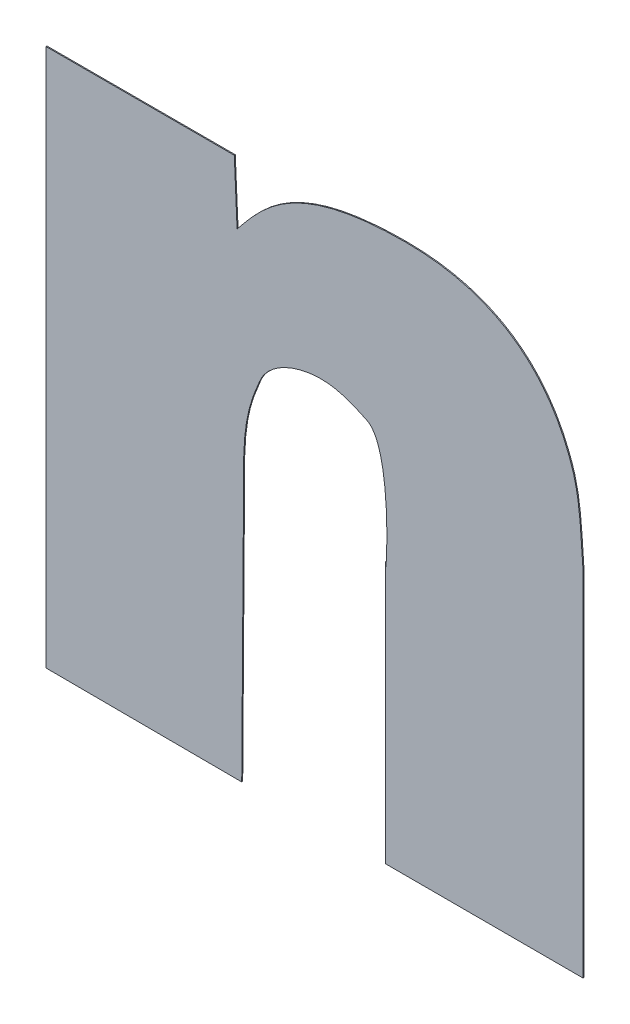
ISO-10303-21;
HEADER;
FILE_DESCRIPTION(('STEP AP214'),'2;1');
FILE_NAME('part.step','',(''),(''),'','','');
FILE_SCHEMA(('AUTOMOTIVE_DESIGN { 1 0 10303 214 1 1 1 1 }'));
ENDSEC;
DATA;
#1=APPLICATION_CONTEXT('core data for automotive mechanical design processes');
#2=APPLICATION_PROTOCOL_DEFINITION('international standard','automotive_design',2000,#1);
#3=PRODUCT_CONTEXT('',#1,'mechanical');
#4=PRODUCT('Part','Part','',(#3));
#5=PRODUCT_RELATED_PRODUCT_CATEGORY('part','',(#4));
#6=PRODUCT_DEFINITION_FORMATION('','',#4);
#7=PRODUCT_DEFINITION_CONTEXT('part definition',#1,'design');
#8=PRODUCT_DEFINITION('design','',#6,#7);
#9=PRODUCT_DEFINITION_SHAPE('','',#8);
#10=(LENGTH_UNIT() NAMED_UNIT(*) SI_UNIT(.MILLI.,.METRE.));
#11=(NAMED_UNIT(*) PLANE_ANGLE_UNIT() SI_UNIT($,.RADIAN.));
#12=(NAMED_UNIT(*) SI_UNIT($,.STERADIAN.) SOLID_ANGLE_UNIT());
#13=UNCERTAINTY_MEASURE_WITH_UNIT(LENGTH_MEASURE(1.E-05),#10,'distance_accuracy_value','');
#14=(GEOMETRIC_REPRESENTATION_CONTEXT(3) GLOBAL_UNCERTAINTY_ASSIGNED_CONTEXT((#13)) GLOBAL_UNIT_ASSIGNED_CONTEXT((#10,
#11,#12)) REPRESENTATION_CONTEXT('',''));
#15=CARTESIAN_POINT('',(0.,0.,0.));
#16=DIRECTION('',(0.,0.,1.));
#17=DIRECTION('',(1.,0.,0.));
#18=AXIS2_PLACEMENT_3D('',#15,#16,#17);
#19=CARTESIAN_POINT('',(2.4951337833481,-0.251924529160018,0.));
#20=DIRECTION('',(0.,1.,0.));
#21=DIRECTION('',(-1.,0.,0.));
#22=AXIS2_PLACEMENT_3D('',#19,#20,#21);
#23=PLANE('',#22);
#24=DIRECTION('',(1.,0.,0.));
#25=VECTOR('',#24,1.);
#26=CARTESIAN_POINT('',(2.4760499004372,-0.251924529160018,0.));
#27=LINE('',#26,#25);
#28=CARTESIAN_POINT('',(2.4760499004372,-0.251924529160018,0.));
#29=VERTEX_POINT('',#28);
#30=CARTESIAN_POINT('',(2.4951337833481,-0.251924529160018,0.));
#31=VERTEX_POINT('',#30);
#32=EDGE_CURVE('E11',#29,#31,#27,.T.);
#33=ORIENTED_EDGE('',*,*,#32,.F.);
#34=DIRECTION('',(0.,0.,1.));
#35=VECTOR('',#34,1.);
#36=CARTESIAN_POINT('',(2.4760499004372,-0.251924529160018,0.));
#37=LINE('',#36,#35);
#38=CARTESIAN_POINT('',(2.4760499004372,-0.251924529160018,0.0001));
#39=VERTEX_POINT('',#38);
#40=EDGE_CURVE('E24',#29,#39,#37,.T.);
#41=ORIENTED_EDGE('',*,*,#40,.T.);
#42=DIRECTION('',(-1.,0.,0.));
#43=VECTOR('',#42,1.);
#44=CARTESIAN_POINT('',(2.4760499004372,-0.251924529160018,0.0001));
#45=LINE('',#44,#43);
#46=CARTESIAN_POINT('',(2.4951337833481,-0.251924529160018,0.0001));
#47=VERTEX_POINT('',#46);
#48=EDGE_CURVE('E142',#47,#39,#45,.T.);
#49=ORIENTED_EDGE('',*,*,#48,.F.);
#50=DIRECTION('',(0.,0.,1.));
#51=VECTOR('',#50,1.);
#52=CARTESIAN_POINT('',(2.4951337833481,-0.251924529160018,0.));
#53=LINE('',#52,#51);
#54=EDGE_CURVE('E299',#31,#47,#53,.T.);
#55=ORIENTED_EDGE('',*,*,#54,.F.);
#56=EDGE_LOOP('',(#33,#41,#49,#55));
#57=FACE_BOUND('',#56,.T.);
#58=ADVANCED_FACE('F17',(#57),#23,.T.);
#59=CARTESIAN_POINT('',(2.495415797224,-0.258260787531251,0.));
#60=DIRECTION('',(0.999010990304726,0.0444639320165391,0.));
#61=DIRECTION('',(-0.0444639320165391,0.999010990304726,0.));
#62=AXIS2_PLACEMENT_3D('',#59,#60,#61);
#63=PLANE('',#62);
#64=DIRECTION('',(0.0444639320165391,-0.999010990304726,0.));
#65=VECTOR('',#64,1.);
#66=CARTESIAN_POINT('',(2.4951337833481,-0.251924529160018,0.));
#67=LINE('',#66,#65);
#68=CARTESIAN_POINT('',(2.495415797224,-0.258260787531251,0.));
#69=VERTEX_POINT('',#68);
#70=EDGE_CURVE('E297',#31,#69,#67,.T.);
#71=ORIENTED_EDGE('',*,*,#70,.F.);
#72=ORIENTED_EDGE('',*,*,#54,.T.);
#73=DIRECTION('',(-0.0444639320165391,0.999010990304726,0.));
#74=VECTOR('',#73,1.);
#75=CARTESIAN_POINT('',(2.4951337833481,-0.251924529160018,0.0001));
#76=LINE('',#75,#74);
#77=CARTESIAN_POINT('',(2.495415797224,-0.258260787531251,0.0001));
#78=VERTEX_POINT('',#77);
#79=EDGE_CURVE('E295',#78,#47,#76,.T.);
#80=ORIENTED_EDGE('',*,*,#79,.F.);
#81=DIRECTION('',(0.,0.,1.));
#82=VECTOR('',#81,1.);
#83=CARTESIAN_POINT('',(2.495415797224,-0.258260787531251,0.));
#84=LINE('',#83,#82);
#85=EDGE_CURVE('E289',#69,#78,#84,.T.);
#86=ORIENTED_EDGE('',*,*,#85,.F.);
#87=EDGE_LOOP('',(#71,#72,#80,#86));
#88=FACE_BOUND('',#87,.T.);
#89=ADVANCED_FACE('F349',(#88),#63,.T.);
#90=CARTESIAN_POINT('',(2.5125254862407,-0.250871626609948,0.));
#91=CARTESIAN_POINT('',(2.5125254862407,-0.250871626609948,0.0001));
#92=CARTESIAN_POINT('',(2.5011503675055,-0.250871626609949,0.));
#93=CARTESIAN_POINT('',(2.5011503675055,-0.250871626609949,0.0001));
#94=CARTESIAN_POINT('',(2.4980480665009,-0.255036254925372,0.));
#95=CARTESIAN_POINT('',(2.4980480665009,-0.255036254925372,0.0001));
#96=CARTESIAN_POINT('',(2.495415797224,-0.258260787531251,0.));
#97=CARTESIAN_POINT('',(2.495415797224,-0.258260787531251,0.0001));
#98=B_SPLINE_SURFACE_WITH_KNOTS('',3,1,((#90,#91),(#92,#93),(#94,#95),(#96,#97)),.UNSPECIFIED.,
.F.,.F.,.F.,(4,4),(2,2),(-1.,0.),(0.,1.E-05),.UNSPECIFIED.);
#99=CARTESIAN_POINT('',(2.495415797224,-0.258260787531251,0.));
#100=CARTESIAN_POINT('',(2.4980480665009,-0.255036254925372,0.));
#101=CARTESIAN_POINT('',(2.5011503675055,-0.250871626609949,0.));
#102=CARTESIAN_POINT('',(2.5125254862407,-0.250871626609948,0.));
#103=B_SPLINE_CURVE_WITH_KNOTS('',3,(#99,#100,#101,#102),.UNSPECIFIED.,.F.,.F.,(4,4),(0.,1.),.UNSPECIFIED.);
#104=CARTESIAN_POINT('',(2.5125254862407,-0.250871626609948,0.));
#105=VERTEX_POINT('',#104);
#106=EDGE_CURVE('E282',#69,#105,#103,.T.);
#107=CARTESIAN_POINT('',(2.5125254862407,-0.250871626609948,0.0001));
#108=CARTESIAN_POINT('',(2.5011503675055,-0.250871626609949,0.0001));
#109=CARTESIAN_POINT('',(2.4980480665009,-0.255036254925372,0.0001));
#110=CARTESIAN_POINT('',(2.495415797224,-0.258260787531251,0.0001));
#111=B_SPLINE_CURVE_WITH_KNOTS('',3,(#107,#108,#109,#110),.UNSPECIFIED.,.F.,.F.,(4,4),(-1.,0.),.UNSPECIFIED.);
#112=CARTESIAN_POINT('',(2.5125254862407,-0.250871626609948,0.0001));
#113=VERTEX_POINT('',#112);
#114=EDGE_CURVE('E277',#113,#78,#111,.T.);
#115=DIRECTION('',(0.,0.,1.));
#116=VECTOR('',#115,1.);
#117=CARTESIAN_POINT('',(2.5125254862407,-0.250871626609948,0.));
#118=LINE('',#117,#116);
#119=EDGE_CURVE('E274',#105,#113,#118,.T.);
#120=ORIENTED_EDGE('',*,*,#106,.F.);
#121=ORIENTED_EDGE('',*,*,#85,.T.);
#122=ORIENTED_EDGE('',*,*,#114,.F.);
#123=ORIENTED_EDGE('',*,*,#119,.F.);
#124=EDGE_LOOP('',(#120,#121,#122,#123));
#125=FACE_BOUND('',#124,.T.);
#126=ADVANCED_FACE('F345',(#125),#98,.T.);
#127=CARTESIAN_POINT('',(2.5295411663316,-0.26272622118634,0.));
#128=CARTESIAN_POINT('',(2.5295411663316,-0.26272622118634,0.0001));
#129=CARTESIAN_POINT('',(2.5289795258176,-0.260872820050871,0.));
#130=CARTESIAN_POINT('',(2.5289795258176,-0.260872820050871,0.0001));
#131=CARTESIAN_POINT('',(2.5281845119793,-0.259096637749483,0.));
#132=CARTESIAN_POINT('',(2.5281845119793,-0.259096637749483,0.0001));
#133=CARTESIAN_POINT('',(2.5260893401169,-0.256082969832977,0.));
#134=CARTESIAN_POINT('',(2.5260893401169,-0.256082969832977,0.0001));
#135=CARTESIAN_POINT('',(2.524888932403,-0.254863830591796,0.));
#136=CARTESIAN_POINT('',(2.524888932403,-0.254863830591796,0.0001));
#137=CARTESIAN_POINT('',(2.5219002497626,-0.252782148364461,0.));
#138=CARTESIAN_POINT('',(2.5219002497626,-0.252782148364461,0.0001));
#139=CARTESIAN_POINT('',(2.5201564501159,-0.252031610993417,0.));
#140=CARTESIAN_POINT('',(2.5201564501159,-0.252031610993417,0.0001));
#141=CARTESIAN_POINT('',(2.5164280546724,-0.251067868009509,0.));
#142=CARTESIAN_POINT('',(2.5164280546724,-0.251067868009509,0.0001));
#143=CARTESIAN_POINT('',(2.5144681504054,-0.25087162660995,0.));
#144=CARTESIAN_POINT('',(2.5144681504054,-0.25087162660995,0.0001));
#145=CARTESIAN_POINT('',(2.5125254862407,-0.250871626609948,0.));
#146=CARTESIAN_POINT('',(2.5125254862407,-0.250871626609948,0.0001));
#147=B_SPLINE_SURFACE_WITH_KNOTS('',3,1,((#127,#128),(#129,#130),(#131,#132),(#133,#134),(#135,
#136),(#137,#138),(#139,#140),(#141,#142),(#143,#144),(#145,#146)),.UNSPECIFIED.,.F.,.F.,.F.,(4,
2,2,2,4),(2,2),(-0.0139215444250208,-0.0103375891774354,-0.0071279179647571,-0.00359508512368,
0.),(0.,1.E-05),.UNSPECIFIED.);
#148=CARTESIAN_POINT('',(2.4185640432084,-0.380049982248792,0.));
#149=DIRECTION('',(0.,0.,-1.));
#150=DIRECTION('',(0.645483566089046,0.763774158969108,0.));
#151=AXIS2_PLACEMENT_3D('',#148,#149,#150);
#152=ELLIPSE('',#151,0.164145222436969,0.0482364832035509);
#153=CARTESIAN_POINT('',(2.5295411663316,-0.26272622118634,0.));
#154=VERTEX_POINT('',#153);
#155=EDGE_CURVE('E272',#105,#154,#152,.T.);
#156=CARTESIAN_POINT('',(2.4185640432084,-0.38004998224879,0.000100000000000001));
#157=DIRECTION('',(0.,0.,1.));
#158=DIRECTION('',(-0.645483566089046,-0.763774158969108,0.));
#159=AXIS2_PLACEMENT_3D('',#156,#157,#158);
#160=ELLIPSE('',#159,0.164145222436967,0.0482364832035505);
#161=CARTESIAN_POINT('',(2.5295411663316,-0.26272622118634,0.0001));
#162=VERTEX_POINT('',#161);
#163=EDGE_CURVE('E269',#162,#113,#160,.T.);
#164=DIRECTION('',(0.,0.,1.));
#165=VECTOR('',#164,1.);
#166=CARTESIAN_POINT('',(2.5295411663316,-0.26272622118634,0.));
#167=LINE('',#166,#165);
#168=EDGE_CURVE('E263',#154,#162,#167,.T.);
#169=ORIENTED_EDGE('',*,*,#155,.F.);
#170=ORIENTED_EDGE('',*,*,#119,.T.);
#171=ORIENTED_EDGE('',*,*,#163,.F.);
#172=ORIENTED_EDGE('',*,*,#168,.F.);
#173=EDGE_LOOP('',(#169,#170,#171,#172));
#174=FACE_BOUND('',#173,.T.);
#175=ADVANCED_FACE('F341',(#174),#147,.T.);
#176=CARTESIAN_POINT('',(2.5304812426885,-0.270566583666157,0.));
#177=CARTESIAN_POINT('',(2.5304812426885,-0.270566583666157,0.0001));
#178=CARTESIAN_POINT('',(2.5301992095122,-0.266223342897407,0.));
#179=CARTESIAN_POINT('',(2.5301992095122,-0.266223342897407,0.0001));
#180=CARTESIAN_POINT('',(2.5301052134675,-0.264841418784442,0.));
#181=CARTESIAN_POINT('',(2.5301052134675,-0.264841418784442,0.0001));
#182=CARTESIAN_POINT('',(2.5295411663316,-0.26272622118634,0.));
#183=CARTESIAN_POINT('',(2.5295411663316,-0.26272622118634,0.0001));
#184=B_SPLINE_SURFACE_WITH_KNOTS('',3,1,((#176,#177),(#178,#179),(#180,#181),(#182,#183)),
.UNSPECIFIED.,.F.,.F.,.F.,(4,4),(2,2),(-1.,0.),(0.,1.E-05),.UNSPECIFIED.);
#185=CARTESIAN_POINT('',(2.5295411663316,-0.26272622118634,0.));
#186=CARTESIAN_POINT('',(2.5301052134675,-0.264841418784442,0.));
#187=CARTESIAN_POINT('',(2.5301992095122,-0.266223342897407,0.));
#188=CARTESIAN_POINT('',(2.5304812426885,-0.270566583666157,0.));
#189=B_SPLINE_CURVE_WITH_KNOTS('',3,(#185,#186,#187,#188),.UNSPECIFIED.,.F.,.F.,(4,4),(0.,1.),.UNSPECIFIED.);
#190=CARTESIAN_POINT('',(2.5304812426885,-0.270566583666157,0.));
#191=VERTEX_POINT('',#190);
#192=EDGE_CURVE('E256',#154,#191,#189,.T.);
#193=CARTESIAN_POINT('',(2.5304812426885,-0.270566583666157,0.0001));
#194=CARTESIAN_POINT('',(2.5301992095122,-0.266223342897407,0.0001));
#195=CARTESIAN_POINT('',(2.5301052134675,-0.264841418784442,0.0001));
#196=CARTESIAN_POINT('',(2.5295411663316,-0.26272622118634,0.0001));
#197=B_SPLINE_CURVE_WITH_KNOTS('',3,(#193,#194,#195,#196),.UNSPECIFIED.,.F.,.F.,(4,4),(-1.,0.),.UNSPECIFIED.);
#198=CARTESIAN_POINT('',(2.5304812426885,-0.270566583666157,0.0001));
#199=VERTEX_POINT('',#198);
#200=EDGE_CURVE('E251',#199,#162,#197,.T.);
#201=DIRECTION('',(0.,0.,1.));
#202=VECTOR('',#201,1.);
#203=CARTESIAN_POINT('',(2.5304812426885,-0.270566583666157,0.));
#204=LINE('',#203,#202);
#205=EDGE_CURVE('E248',#191,#199,#204,.T.);
#206=ORIENTED_EDGE('',*,*,#192,.F.);
#207=ORIENTED_EDGE('',*,*,#168,.T.);
#208=ORIENTED_EDGE('',*,*,#200,.F.);
#209=ORIENTED_EDGE('',*,*,#205,.F.);
#210=EDGE_LOOP('',(#206,#207,#208,#209));
#211=FACE_BOUND('',#210,.T.);
#212=ADVANCED_FACE('F337',(#211),#184,.T.);
#213=CARTESIAN_POINT('',(2.5304812426885,-0.30648749551909,0.));
#214=DIRECTION('',(1.,0.,0.));
#215=DIRECTION('',(0.,1.,0.));
#216=AXIS2_PLACEMENT_3D('',#213,#214,#215);
#217=PLANE('',#216);
#218=DIRECTION('',(0.,-1.,0.));
#219=VECTOR('',#218,1.);
#220=CARTESIAN_POINT('',(2.5304812426885,-0.270566583666157,0.));
#221=LINE('',#220,#219);
#222=CARTESIAN_POINT('',(2.5304812426885,-0.30648749551909,0.));
#223=VERTEX_POINT('',#222);
#224=EDGE_CURVE('E246',#191,#223,#221,.T.);
#225=ORIENTED_EDGE('',*,*,#224,.F.);
#226=ORIENTED_EDGE('',*,*,#205,.T.);
#227=DIRECTION('',(0.,1.,0.));
#228=VECTOR('',#227,1.);
#229=CARTESIAN_POINT('',(2.5304812426885,-0.270566583666157,0.0001));
#230=LINE('',#229,#228);
#231=CARTESIAN_POINT('',(2.5304812426885,-0.30648749551909,0.0001));
#232=VERTEX_POINT('',#231);
#233=EDGE_CURVE('E243',#232,#199,#230,.T.);
#234=ORIENTED_EDGE('',*,*,#233,.F.);
#235=DIRECTION('',(0.,0.,1.));
#236=VECTOR('',#235,1.);
#237=CARTESIAN_POINT('',(2.5304812426885,-0.30648749551909,0.));
#238=LINE('',#237,#236);
#239=EDGE_CURVE('E240',#223,#232,#238,.T.);
#240=ORIENTED_EDGE('',*,*,#239,.F.);
#241=EDGE_LOOP('',(#225,#226,#234,#240));
#242=FACE_BOUND('',#241,.T.);
#243=ADVANCED_FACE('F333',(#242),#217,.T.);
#244=CARTESIAN_POINT('',(2.5104572834207,-0.306468716957201,0.));
#245=DIRECTION('',(-0.000937804226451135,-0.99999956026152,0.));
#246=DIRECTION('',(0.99999956026152,-0.000937804226451135,0.));
#247=AXIS2_PLACEMENT_3D('',#244,#245,#246);
#248=PLANE('',#247);
#249=DIRECTION('',(-0.99999956026152,0.000937804226451135,0.));
#250=VECTOR('',#249,1.);
#251=CARTESIAN_POINT('',(2.5304812426885,-0.30648749551909,0.));
#252=LINE('',#251,#250);
#253=CARTESIAN_POINT('',(2.5104572834207,-0.306468716957201,0.));
#254=VERTEX_POINT('',#253);
#255=EDGE_CURVE('E238',#223,#254,#252,.T.);
#256=ORIENTED_EDGE('',*,*,#255,.F.);
#257=ORIENTED_EDGE('',*,*,#239,.T.);
#258=DIRECTION('',(0.99999956026152,-0.000937804226451135,0.));
#259=VECTOR('',#258,1.);
#260=CARTESIAN_POINT('',(2.5304812426885,-0.30648749551909,0.0001));
#261=LINE('',#260,#259);
#262=CARTESIAN_POINT('',(2.5104572834207,-0.306468716957201,0.0001));
#263=VERTEX_POINT('',#262);
#264=EDGE_CURVE('E235',#263,#232,#261,.T.);
#265=ORIENTED_EDGE('',*,*,#264,.F.);
#266=DIRECTION('',(0.,0.,1.));
#267=VECTOR('',#266,1.);
#268=CARTESIAN_POINT('',(2.5104572834207,-0.306468716957201,0.));
#269=LINE('',#268,#267);
#270=EDGE_CURVE('E232',#254,#263,#269,.T.);
#271=ORIENTED_EDGE('',*,*,#270,.F.);
#272=EDGE_LOOP('',(#256,#257,#265,#271));
#273=FACE_BOUND('',#272,.T.);
#274=ADVANCED_FACE('F329',(#273),#248,.T.);
#275=CARTESIAN_POINT('',(2.5104572834207,-0.279939298733609,0.));
#276=DIRECTION('',(-1.,0.,0.));
#277=DIRECTION('',(0.,-1.,0.));
#278=AXIS2_PLACEMENT_3D('',#275,#276,#277);
#279=PLANE('',#278);
#280=DIRECTION('',(0.,1.,0.));
#281=VECTOR('',#280,1.);
#282=CARTESIAN_POINT('',(2.5104572834207,-0.306468716957201,0.));
#283=LINE('',#282,#281);
#284=CARTESIAN_POINT('',(2.5104572834207,-0.279939298733609,0.));
#285=VERTEX_POINT('',#284);
#286=EDGE_CURVE('E230',#254,#285,#283,.T.);
#287=ORIENTED_EDGE('',*,*,#286,.F.);
#288=ORIENTED_EDGE('',*,*,#270,.T.);
#289=DIRECTION('',(0.,-1.,0.));
#290=VECTOR('',#289,1.);
#291=CARTESIAN_POINT('',(2.5104572834207,-0.306468716957201,0.0001));
#292=LINE('',#291,#290);
#293=CARTESIAN_POINT('',(2.5104572834207,-0.279939298733609,0.0001));
#294=VERTEX_POINT('',#293);
#295=EDGE_CURVE('E227',#294,#263,#292,.T.);
#296=ORIENTED_EDGE('',*,*,#295,.F.);
#297=DIRECTION('',(0.,0.,1.));
#298=VECTOR('',#297,1.);
#299=CARTESIAN_POINT('',(2.5104572834207,-0.279939298733609,0.));
#300=LINE('',#299,#298);
#301=EDGE_CURVE('E221',#285,#294,#300,.T.);
#302=ORIENTED_EDGE('',*,*,#301,.F.);
#303=EDGE_LOOP('',(#287,#288,#296,#302));
#304=FACE_BOUND('',#303,.T.);
#305=ADVANCED_FACE('F325',(#304),#279,.T.);
#306=CARTESIAN_POINT('',(2.5085770920016,-0.268479563578855,0.));
#307=CARTESIAN_POINT('',(2.5085770920016,-0.268479563578855,0.0001));
#308=CARTESIAN_POINT('',(2.5113973793436,-0.269814499377234,0.));
#309=CARTESIAN_POINT('',(2.5113973793436,-0.269814499377234,0.0001));
#310=CARTESIAN_POINT('',(2.5104572833545,-0.283079202018295,0.));
#311=CARTESIAN_POINT('',(2.5104572833545,-0.283079202018295,0.0001));
#312=CARTESIAN_POINT('',(2.5104572834207,-0.279939298733609,0.));
#313=CARTESIAN_POINT('',(2.5104572834207,-0.279939298733609,0.0001));
#314=B_SPLINE_SURFACE_WITH_KNOTS('',3,1,((#306,#307),(#308,#309),(#310,#311),(#312,#313)),
.UNSPECIFIED.,.F.,.F.,.F.,(4,4),(2,2),(-1.,0.),(0.,1.E-05),.UNSPECIFIED.);
#315=CARTESIAN_POINT('',(2.5104572834207,-0.279939298733609,0.));
#316=CARTESIAN_POINT('',(2.5104572833545,-0.283079202018295,0.));
#317=CARTESIAN_POINT('',(2.5113973793436,-0.269814499377234,0.));
#318=CARTESIAN_POINT('',(2.5085770920016,-0.268479563578855,0.));
#319=B_SPLINE_CURVE_WITH_KNOTS('',3,(#315,#316,#317,#318),.UNSPECIFIED.,.F.,.F.,(4,4),(0.,1.),.UNSPECIFIED.);
#320=CARTESIAN_POINT('',(2.5085770920016,-0.268479563578855,0.));
#321=VERTEX_POINT('',#320);
#322=EDGE_CURVE('E214',#285,#321,#319,.T.);
#323=CARTESIAN_POINT('',(2.5085770920016,-0.268479563578855,0.0001));
#324=CARTESIAN_POINT('',(2.5113973793436,-0.269814499377234,0.0001));
#325=CARTESIAN_POINT('',(2.5104572833545,-0.283079202018295,0.0001));
#326=CARTESIAN_POINT('',(2.5104572834207,-0.279939298733609,0.0001));
#327=B_SPLINE_CURVE_WITH_KNOTS('',3,(#323,#324,#325,#326),.UNSPECIFIED.,.F.,.F.,(4,4),(-1.,0.),.UNSPECIFIED.);
#328=CARTESIAN_POINT('',(2.5085770920016,-0.268479563578855,0.0001));
#329=VERTEX_POINT('',#328);
#330=EDGE_CURVE('E209',#329,#294,#327,.T.);
#331=DIRECTION('',(0.,0.,1.));
#332=VECTOR('',#331,1.);
#333=CARTESIAN_POINT('',(2.5085770920016,-0.268479563578855,0.));
#334=LINE('',#333,#332);
#335=EDGE_CURVE('E203',#321,#329,#334,.T.);
#336=CARTESIAN_POINT('',(2.5085770920016,-0.268479563578855,0.));
#337=CARTESIAN_POINT('',(2.5085770920016,-0.268479563578855,0.0001));
#338=CARTESIAN_POINT('',(2.5113973793436,-0.269814499377234,0.));
#339=CARTESIAN_POINT('',(2.5113973793436,-0.269814499377234,0.0001));
#340=CARTESIAN_POINT('',(2.5104572833545,-0.283079202018295,0.));
#341=CARTESIAN_POINT('',(2.5104572833545,-0.283079202018295,0.0001));
#342=CARTESIAN_POINT('',(2.5104572834207,-0.279939298733609,0.));
#343=CARTESIAN_POINT('',(2.5104572834207,-0.279939298733609,0.0001));
#344=CARTESIAN_POINT('',(2.51045728342183,-0.279885920377769,0.));
#345=CARTESIAN_POINT('',(2.51045728342183,-0.279885920377769,0.0001));
#346=CARTESIAN_POINT('',(2.51045728342295,-0.27983254202193,0.));
#347=CARTESIAN_POINT('',(2.51045728342295,-0.27983254202193,0.0001));
#348=CARTESIAN_POINT('',(2.51045728342408,-0.27977916366609,0.));
#349=CARTESIAN_POINT('',(2.51045728342408,-0.27977916366609,0.0001));
#350=B_SPLINE_SURFACE_WITH_KNOTS('',3,1,((#336,#337),(#338,#339),(#340,#341),(#342,#343),(#344,
#345),(#346,#347),(#348,#349)),.UNSPECIFIED.,.F.,.F.,.F.,(4,3,4),(2,2),(-1.,0.,0.017),(0.,
1.E-05),.UNSPECIFIED.);
#351=ORIENTED_EDGE('',*,*,#322,.F.);
#352=ORIENTED_EDGE('',*,*,#301,.T.);
#353=ORIENTED_EDGE('',*,*,#330,.F.);
#354=ORIENTED_EDGE('',*,*,#335,.F.);
#355=EDGE_LOOP('',(#351,#352,#353,#354));
#356=FACE_BOUND('',#355,.T.);
#357=ADVANCED_FACE('F321',(#356),#350,.T.);
#358=CARTESIAN_POINT('',(2.5037826174297,-0.267163457969408,0.));
#359=CARTESIAN_POINT('',(2.5037826174297,-0.267163457969408,0.0001));
#360=CARTESIAN_POINT('',(2.5058508202496,-0.267116430928325,0.));
#361=CARTESIAN_POINT('',(2.5058508202496,-0.267116430928325,0.0001));
#362=CARTESIAN_POINT('',(2.5076370156448,-0.268037735174161,0.));
#363=CARTESIAN_POINT('',(2.5076370156448,-0.268037735174161,0.0001));
#364=CARTESIAN_POINT('',(2.5085770920016,-0.268479563578855,0.));
#365=CARTESIAN_POINT('',(2.5085770920016,-0.268479563578855,0.0001));
#366=B_SPLINE_SURFACE_WITH_KNOTS('',3,1,((#358,#359),(#360,#361),(#362,#363),(#364,#365)),
.UNSPECIFIED.,.F.,.F.,.F.,(4,4),(2,2),(-1.,0.),(0.,1.E-05),.UNSPECIFIED.);
#367=CARTESIAN_POINT('',(2.5085770920016,-0.268479563578855,0.));
#368=CARTESIAN_POINT('',(2.5076370156448,-0.268037735174161,0.));
#369=CARTESIAN_POINT('',(2.5058508202496,-0.267116430928325,0.));
#370=CARTESIAN_POINT('',(2.5037826174297,-0.267163457969408,0.));
#371=B_SPLINE_CURVE_WITH_KNOTS('',3,(#367,#368,#369,#370),.UNSPECIFIED.,.F.,.F.,(4,4),(0.,1.),.UNSPECIFIED.);
#372=CARTESIAN_POINT('',(2.5037826174297,-0.267163457969408,0.));
#373=VERTEX_POINT('',#372);
#374=EDGE_CURVE('E196',#321,#373,#371,.T.);
#375=CARTESIAN_POINT('',(2.5037826174297,-0.267163457969408,0.0001));
#376=CARTESIAN_POINT('',(2.5058508202496,-0.267116430928325,0.0001));
#377=CARTESIAN_POINT('',(2.5076370156448,-0.268037735174161,0.0001));
#378=CARTESIAN_POINT('',(2.5085770920016,-0.268479563578855,0.0001));
#379=B_SPLINE_CURVE_WITH_KNOTS('',3,(#375,#376,#377,#378),.UNSPECIFIED.,.F.,.F.,(4,4),(-1.,0.),.UNSPECIFIED.);
#380=CARTESIAN_POINT('',(2.5037826174297,-0.267163457969408,0.0001));
#381=VERTEX_POINT('',#380);
#382=EDGE_CURVE('E191',#381,#329,#379,.T.);
#383=DIRECTION('',(0.,0.,1.));
#384=VECTOR('',#383,1.);
#385=CARTESIAN_POINT('',(2.5037826174297,-0.267163457969408,0.));
#386=LINE('',#385,#384);
#387=EDGE_CURVE('E185',#373,#381,#386,.T.);
#388=ORIENTED_EDGE('',*,*,#374,.F.);
#389=ORIENTED_EDGE('',*,*,#335,.T.);
#390=ORIENTED_EDGE('',*,*,#382,.F.);
#391=ORIENTED_EDGE('',*,*,#387,.F.);
#392=EDGE_LOOP('',(#388,#389,#390,#391));
#393=FACE_BOUND('',#392,.T.);
#394=ADVANCED_FACE('F317',(#393),#366,.T.);
#395=CARTESIAN_POINT('',(2.4976720178957,-0.270566583666157,0.));
#396=CARTESIAN_POINT('',(2.4976720178957,-0.270566583666157,0.0001));
#397=CARTESIAN_POINT('',(2.4985180982285,-0.268394972962993,0.));
#398=CARTESIAN_POINT('',(2.4985180982285,-0.268394972962993,0.0001));
#399=CARTESIAN_POINT('',(2.5013383789063,-0.267210446305092,0.));
#400=CARTESIAN_POINT('',(2.5013383789063,-0.267210446305092,0.0001));
#401=CARTESIAN_POINT('',(2.5037826174297,-0.267163457969408,0.));
#402=CARTESIAN_POINT('',(2.5037826174297,-0.267163457969408,0.0001));
#403=B_SPLINE_SURFACE_WITH_KNOTS('',3,1,((#395,#396),(#397,#398),(#399,#400),(#401,#402)),
.UNSPECIFIED.,.F.,.F.,.F.,(4,4),(2,2),(-1.,0.),(0.,1.E-05),.UNSPECIFIED.);
#404=CARTESIAN_POINT('',(2.5037826174297,-0.267163457969408,0.));
#405=CARTESIAN_POINT('',(2.5013383789063,-0.267210446305092,0.));
#406=CARTESIAN_POINT('',(2.4985180982285,-0.268394972962993,0.));
#407=CARTESIAN_POINT('',(2.4976720178957,-0.270566583666157,0.));
#408=B_SPLINE_CURVE_WITH_KNOTS('',3,(#404,#405,#406,#407),.UNSPECIFIED.,.F.,.F.,(4,4),(0.,1.),.UNSPECIFIED.);
#409=CARTESIAN_POINT('',(2.4976720178957,-0.270566583666157,0.));
#410=VERTEX_POINT('',#409);
#411=EDGE_CURVE('E178',#373,#410,#408,.T.);
#412=CARTESIAN_POINT('',(2.4976720178957,-0.270566583666157,0.0001));
#413=CARTESIAN_POINT('',(2.4985180982285,-0.268394972962993,0.0001));
#414=CARTESIAN_POINT('',(2.5013383789063,-0.267210446305092,0.0001));
#415=CARTESIAN_POINT('',(2.5037826174297,-0.267163457969408,0.0001));
#416=B_SPLINE_CURVE_WITH_KNOTS('',3,(#412,#413,#414,#415),.UNSPECIFIED.,.F.,.F.,(4,4),(-1.,0.),.UNSPECIFIED.);
#417=CARTESIAN_POINT('',(2.4976720178957,-0.270566583666157,0.0001));
#418=VERTEX_POINT('',#417);
#419=EDGE_CURVE('E173',#418,#381,#416,.T.);
#420=DIRECTION('',(0.,0.,1.));
#421=VECTOR('',#420,1.);
#422=CARTESIAN_POINT('',(2.4976720178957,-0.270566583666157,0.));
#423=LINE('',#422,#421);
#424=EDGE_CURVE('E167',#410,#418,#423,.T.);
#425=ORIENTED_EDGE('',*,*,#411,.F.);
#426=ORIENTED_EDGE('',*,*,#387,.T.);
#427=ORIENTED_EDGE('',*,*,#419,.F.);
#428=ORIENTED_EDGE('',*,*,#424,.F.);
#429=EDGE_LOOP('',(#425,#426,#427,#428));
#430=FACE_BOUND('',#429,.T.);
#431=ADVANCED_FACE('F313',(#430),#403,.T.);
#432=CARTESIAN_POINT('',(2.4960738726068,-0.28053156206256,0.));
#433=CARTESIAN_POINT('',(2.4960738726068,-0.28053156206256,0.0001));
#434=CARTESIAN_POINT('',(2.4959798572301,-0.275022611912968,0.));
#435=CARTESIAN_POINT('',(2.4959798572301,-0.275022611912968,0.0001));
#436=CARTESIAN_POINT('',(2.4965439043344,-0.273217644406874,0.));
#437=CARTESIAN_POINT('',(2.4965439043344,-0.273217644406874,0.0001));
#438=CARTESIAN_POINT('',(2.4976720178957,-0.270566583666157,0.));
#439=CARTESIAN_POINT('',(2.4976720178957,-0.270566583666157,0.0001));
#440=B_SPLINE_SURFACE_WITH_KNOTS('',3,1,((#432,#433),(#434,#435),(#436,#437),(#438,#439)),
.UNSPECIFIED.,.F.,.F.,.F.,(4,4),(2,2),(-1.,0.),(0.,1.E-05),.UNSPECIFIED.);
#441=CARTESIAN_POINT('',(2.4976720178957,-0.270566583666157,0.));
#442=CARTESIAN_POINT('',(2.4965439043344,-0.273217644406874,0.));
#443=CARTESIAN_POINT('',(2.4959798572301,-0.275022611912968,0.));
#444=CARTESIAN_POINT('',(2.4960738726068,-0.28053156206256,0.));
#445=B_SPLINE_CURVE_WITH_KNOTS('',3,(#441,#442,#443,#444),.UNSPECIFIED.,.F.,.F.,(4,4),(0.,1.),.UNSPECIFIED.);
#446=CARTESIAN_POINT('',(2.4960738726068,-0.28053156206256,0.));
#447=VERTEX_POINT('',#446);
#448=EDGE_CURVE('E160',#410,#447,#445,.T.);
#449=CARTESIAN_POINT('',(2.4960738726068,-0.28053156206256,0.0001));
#450=CARTESIAN_POINT('',(2.4959798572301,-0.275022611912968,0.0001));
#451=CARTESIAN_POINT('',(2.4965439043344,-0.273217644406874,0.0001));
#452=CARTESIAN_POINT('',(2.4976720178957,-0.270566583666157,0.0001));
#453=B_SPLINE_CURVE_WITH_KNOTS('',3,(#449,#450,#451,#452),.UNSPECIFIED.,.F.,.F.,(4,4),(-1.,0.),.UNSPECIFIED.);
#454=CARTESIAN_POINT('',(2.4960738726068,-0.28053156206256,0.0001));
#455=VERTEX_POINT('',#454);
#456=EDGE_CURVE('E155',#455,#418,#453,.T.);
#457=DIRECTION('',(0.,0.,1.));
#458=VECTOR('',#457,1.);
#459=CARTESIAN_POINT('',(2.4960738726068,-0.28053156206256,0.));
#460=LINE('',#459,#458);
#461=EDGE_CURVE('E152',#447,#455,#460,.T.);
#462=ORIENTED_EDGE('',*,*,#448,.F.);
#463=ORIENTED_EDGE('',*,*,#424,.T.);
#464=ORIENTED_EDGE('',*,*,#456,.F.);
#465=ORIENTED_EDGE('',*,*,#461,.F.);
#466=EDGE_LOOP('',(#462,#463,#464,#465));
#467=FACE_BOUND('',#466,.T.);
#468=ADVANCED_FACE('F309',(#467),#440,.T.);
#469=CARTESIAN_POINT('',(2.4958858418533,-0.306572124840331,0.));
#470=DIRECTION('',(0.999973931858869,-0.0072204987857048,0.));
#471=DIRECTION('',(0.0072204987857048,0.999973931858869,0.));
#472=AXIS2_PLACEMENT_3D('',#469,#470,#471);
#473=PLANE('',#472);
#474=DIRECTION('',(-0.0072204987857048,-0.999973931858869,0.));
#475=VECTOR('',#474,1.);
#476=CARTESIAN_POINT('',(2.4960738726068,-0.28053156206256,0.));
#477=LINE('',#476,#475);
#478=CARTESIAN_POINT('',(2.4958858418533,-0.306572124840331,0.));
#479=VERTEX_POINT('',#478);
#480=EDGE_CURVE('E150',#447,#479,#477,.T.);
#481=ORIENTED_EDGE('',*,*,#480,.F.);
#482=ORIENTED_EDGE('',*,*,#461,.T.);
#483=DIRECTION('',(0.0072204987857048,0.999973931858869,0.));
#484=VECTOR('',#483,1.);
#485=CARTESIAN_POINT('',(2.4960738726068,-0.28053156206256,0.0001));
#486=LINE('',#485,#484);
#487=CARTESIAN_POINT('',(2.4958858418533,-0.306572124840331,0.0001));
#488=VERTEX_POINT('',#487);
#489=EDGE_CURVE('E148',#488,#455,#486,.T.);
#490=ORIENTED_EDGE('',*,*,#489,.F.);
#491=DIRECTION('',(0.,0.,1.));
#492=VECTOR('',#491,1.);
#493=CARTESIAN_POINT('',(2.4958858418533,-0.306572124840331,0.));
#494=LINE('',#493,#492);
#495=EDGE_CURVE('E127',#479,#488,#494,.T.);
#496=ORIENTED_EDGE('',*,*,#495,.F.);
#497=EDGE_LOOP('',(#481,#482,#490,#496));
#498=FACE_BOUND('',#497,.T.);
#499=ADVANCED_FACE('F307',(#498),#473,.T.);
#500=CARTESIAN_POINT('',(2.4760499004372,-0.30648749551909,0.));
#501=DIRECTION('',(-0.004266424730504,-0.999990898768593,0.));
#502=DIRECTION('',(0.999990898768593,-0.004266424730504,0.));
#503=AXIS2_PLACEMENT_3D('',#500,#501,#502);
#504=PLANE('',#503);
#505=DIRECTION('',(-0.999990898768593,0.004266424730504,0.));
#506=VECTOR('',#505,1.);
#507=CARTESIAN_POINT('',(2.4958858418533,-0.306572124840331,0.));
#508=LINE('',#507,#506);
#509=CARTESIAN_POINT('',(2.4760499004372,-0.30648749551909,0.));
#510=VERTEX_POINT('',#509);
#511=EDGE_CURVE('E131',#479,#510,#508,.T.);
#512=ORIENTED_EDGE('',*,*,#511,.F.);
#513=ORIENTED_EDGE('',*,*,#495,.T.);
#514=DIRECTION('',(0.999990898768593,-0.004266424730504,0.));
#515=VECTOR('',#514,1.);
#516=CARTESIAN_POINT('',(2.4958858418533,-0.306572124840331,0.0001));
#517=LINE('',#516,#515);
#518=CARTESIAN_POINT('',(2.4760499004372,-0.30648749551909,0.0001));
#519=VERTEX_POINT('',#518);
#520=EDGE_CURVE('E120',#519,#488,#517,.T.);
#521=ORIENTED_EDGE('',*,*,#520,.F.);
#522=DIRECTION('',(0.,0.,1.));
#523=VECTOR('',#522,1.);
#524=CARTESIAN_POINT('',(2.4760499004372,-0.30648749551909,0.));
#525=LINE('',#524,#523);
#526=EDGE_CURVE('E124',#510,#519,#525,.T.);
#527=ORIENTED_EDGE('',*,*,#526,.F.);
#528=EDGE_LOOP('',(#512,#513,#521,#527));
#529=FACE_BOUND('',#528,.T.);
#530=ADVANCED_FACE('F123',(#529),#504,.T.);
#531=CARTESIAN_POINT('',(2.4760499004372,-0.251924529160018,0.));
#532=DIRECTION('',(-1.,0.,0.));
#533=DIRECTION('',(0.,-1.,0.));
#534=AXIS2_PLACEMENT_3D('',#531,#532,#533);
#535=PLANE('',#534);
#536=DIRECTION('',(0.,1.,0.));
#537=VECTOR('',#536,1.);
#538=CARTESIAN_POINT('',(2.4760499004372,-0.30648749551909,0.));
#539=LINE('',#538,#537);
#540=EDGE_CURVE('E137',#510,#29,#539,.T.);
#541=ORIENTED_EDGE('',*,*,#540,.F.);
#542=ORIENTED_EDGE('',*,*,#526,.T.);
#543=DIRECTION('',(0.,-1.,0.));
#544=VECTOR('',#543,1.);
#545=CARTESIAN_POINT('',(2.4760499004372,-0.30648749551909,0.0001));
#546=LINE('',#545,#544);
#547=EDGE_CURVE('E136',#39,#519,#546,.T.);
#548=ORIENTED_EDGE('',*,*,#547,.F.);
#549=ORIENTED_EDGE('',*,*,#40,.F.);
#550=EDGE_LOOP('',(#541,#542,#548,#549));
#551=FACE_BOUND('',#550,.T.);
#552=ADVANCED_FACE('F135',(#551),#535,.T.);
#553=CARTESIAN_POINT('',(2.5018021980851,-0.2808536826071,0.));
#554=DIRECTION('',(0.,0.,1.));
#555=DIRECTION('',(1.,0.,0.));
#556=AXIS2_PLACEMENT_3D('',#553,#554,#555);
#557=PLANE('',#556);
#558=ORIENTED_EDGE('',*,*,#540,.T.);
#559=ORIENTED_EDGE('',*,*,#32,.T.);
#560=ORIENTED_EDGE('',*,*,#70,.T.);
#561=ORIENTED_EDGE('',*,*,#106,.T.);
#562=ORIENTED_EDGE('',*,*,#155,.T.);
#563=ORIENTED_EDGE('',*,*,#192,.T.);
#564=ORIENTED_EDGE('',*,*,#224,.T.);
#565=ORIENTED_EDGE('',*,*,#255,.T.);
#566=ORIENTED_EDGE('',*,*,#286,.T.);
#567=ORIENTED_EDGE('',*,*,#322,.T.);
#568=ORIENTED_EDGE('',*,*,#374,.T.);
#569=ORIENTED_EDGE('',*,*,#411,.T.);
#570=ORIENTED_EDGE('',*,*,#448,.T.);
#571=ORIENTED_EDGE('',*,*,#480,.T.);
#572=ORIENTED_EDGE('',*,*,#511,.T.);
#573=EDGE_LOOP('',(#558,#559,#560,#561,#562,#563,#564,#565,#566,#567,#568,#569,#570,#571,#572));
#574=FACE_BOUND('',#573,.T.);
#575=ADVANCED_FACE('F302',(#574),#557,.F.);
#576=CARTESIAN_POINT('',(2.5018021980851,-0.2808536826071,0.0001));
#577=DIRECTION('',(0.,0.,1.));
#578=DIRECTION('',(1.,0.,0.));
#579=AXIS2_PLACEMENT_3D('',#576,#577,#578);
#580=PLANE('',#579);
#581=ORIENTED_EDGE('',*,*,#547,.T.);
#582=ORIENTED_EDGE('',*,*,#520,.T.);
#583=ORIENTED_EDGE('',*,*,#489,.T.);
#584=ORIENTED_EDGE('',*,*,#456,.T.);
#585=ORIENTED_EDGE('',*,*,#419,.T.);
#586=ORIENTED_EDGE('',*,*,#382,.T.);
#587=ORIENTED_EDGE('',*,*,#330,.T.);
#588=ORIENTED_EDGE('',*,*,#295,.T.);
#589=ORIENTED_EDGE('',*,*,#264,.T.);
#590=ORIENTED_EDGE('',*,*,#233,.T.);
#591=ORIENTED_EDGE('',*,*,#200,.T.);
#592=ORIENTED_EDGE('',*,*,#163,.T.);
#593=ORIENTED_EDGE('',*,*,#114,.T.);
#594=ORIENTED_EDGE('',*,*,#79,.T.);
#595=ORIENTED_EDGE('',*,*,#48,.T.);
#596=EDGE_LOOP('',(#581,#582,#583,#584,#585,#586,#587,#588,#589,#590,#591,#592,#593,#594,#595));
#597=FACE_BOUND('',#596,.T.);
#598=ADVANCED_FACE('F140',(#597),#580,.T.);
#599=CLOSED_SHELL('',(#58,#89,#126,#175,#212,#243,#274,#305,#357,#394,#431,#468,#499,#530,#552,
#575,#598));
#600=MANIFOLD_SOLID_BREP('B1',#599);
#601=ADVANCED_BREP_SHAPE_REPRESENTATION('',(#18,#600),#14);
#602=SHAPE_DEFINITION_REPRESENTATION(#9,#601);
ENDSEC;
END-ISO-10303-21;
